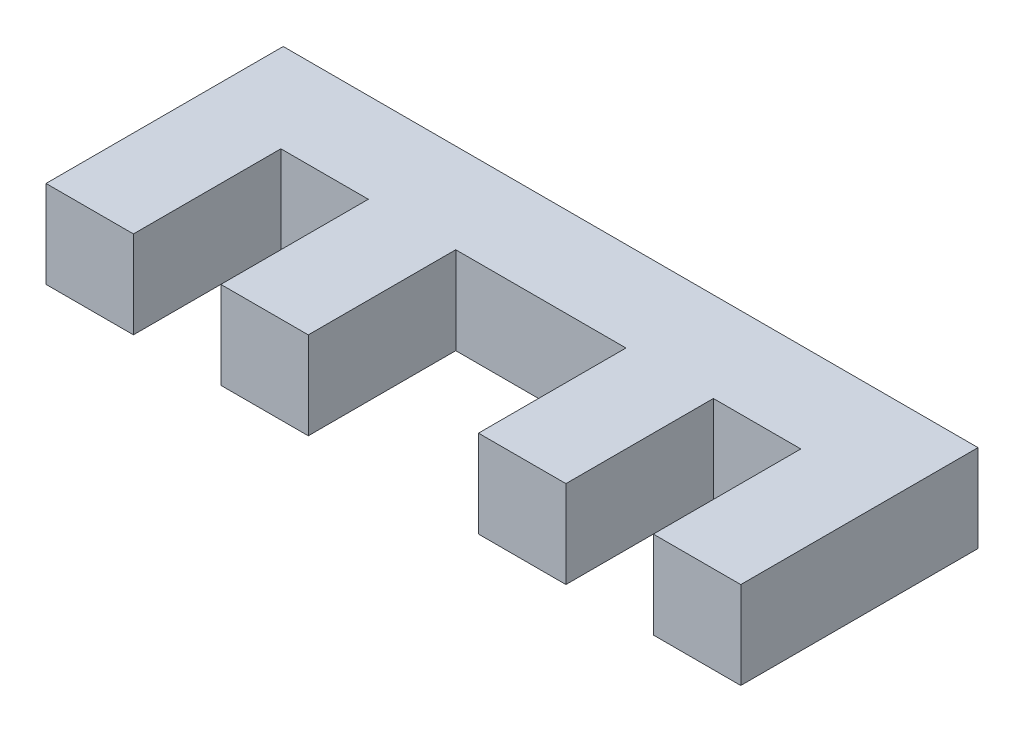
ISO-10303-21;
HEADER;
FILE_DESCRIPTION(('STEP AP214'),'2;1');
FILE_NAME('part.step','',(''),(''),'','','');
FILE_SCHEMA(('AUTOMOTIVE_DESIGN { 1 0 10303 214 1 1 1 1 }'));
ENDSEC;
DATA;
#1=APPLICATION_CONTEXT('core data for automotive mechanical design processes');
#2=APPLICATION_PROTOCOL_DEFINITION('international standard','automotive_design',2000,#1);
#3=PRODUCT_CONTEXT('',#1,'mechanical');
#4=PRODUCT('Part','Part','',(#3));
#5=PRODUCT_RELATED_PRODUCT_CATEGORY('part','',(#4));
#6=PRODUCT_DEFINITION_FORMATION('','',#4);
#7=PRODUCT_DEFINITION_CONTEXT('part definition',#1,'design');
#8=PRODUCT_DEFINITION('design','',#6,#7);
#9=PRODUCT_DEFINITION_SHAPE('','',#8);
#10=(LENGTH_UNIT() NAMED_UNIT(*) SI_UNIT(.MILLI.,.METRE.));
#11=(NAMED_UNIT(*) PLANE_ANGLE_UNIT() SI_UNIT($,.RADIAN.));
#12=(NAMED_UNIT(*) SI_UNIT($,.STERADIAN.) SOLID_ANGLE_UNIT());
#13=UNCERTAINTY_MEASURE_WITH_UNIT(LENGTH_MEASURE(1.E-05),#10,'distance_accuracy_value','');
#14=(GEOMETRIC_REPRESENTATION_CONTEXT(3) GLOBAL_UNCERTAINTY_ASSIGNED_CONTEXT((#13)) GLOBAL_UNIT_ASSIGNED_CONTEXT((#10,
#11,#12)) REPRESENTATION_CONTEXT('',''));
#15=CARTESIAN_POINT('',(0.,0.,0.));
#16=DIRECTION('',(0.,0.,1.));
#17=DIRECTION('',(1.,0.,0.));
#18=AXIS2_PLACEMENT_3D('',#15,#16,#17);
#19=CARTESIAN_POINT('',(0.,3.175,-8.61483333333333));
#20=DIRECTION('',(1.,0.,0.));
#21=DIRECTION('',(0.,0.,-1.));
#22=AXIS2_PLACEMENT_3D('',#19,#20,#21);
#23=PLANE('',#22);
#24=DIRECTION('',(0.,0.,1.));
#25=VECTOR('',#24,1.);
#26=CARTESIAN_POINT('',(0.,0.,-8.61483333333333));
#27=LINE('',#26,#25);
#28=CARTESIAN_POINT('',(0.,0.,-8.61483333333333));
#29=VERTEX_POINT('',#28);
#30=CARTESIAN_POINT('',(0.,0.,0.));
#31=VERTEX_POINT('',#30);
#32=EDGE_CURVE('E188',#29,#31,#27,.T.);
#33=ORIENTED_EDGE('',*,*,#32,.T.);
#34=DIRECTION('',(0.,-1.,0.));
#35=VECTOR('',#34,1.);
#36=CARTESIAN_POINT('',(0.,3.175,0.));
#37=LINE('',#36,#35);
#38=CARTESIAN_POINT('',(0.,3.175,0.));
#39=VERTEX_POINT('',#38);
#40=EDGE_CURVE('E11',#39,#31,#37,.T.);
#41=ORIENTED_EDGE('',*,*,#40,.F.);
#42=DIRECTION('',(0.,0.,1.));
#43=VECTOR('',#42,1.);
#44=CARTESIAN_POINT('',(0.,3.175,-8.61483333333333));
#45=LINE('',#44,#43);
#46=CARTESIAN_POINT('',(0.,3.175,-8.61483333333333));
#47=VERTEX_POINT('',#46);
#48=EDGE_CURVE('E234',#47,#39,#45,.T.);
#49=ORIENTED_EDGE('',*,*,#48,.F.);
#50=DIRECTION('',(0.,-1.,0.));
#51=VECTOR('',#50,1.);
#52=CARTESIAN_POINT('',(0.,3.175,-8.61483333333333));
#53=LINE('',#52,#51);
#54=EDGE_CURVE('E184',#47,#29,#53,.T.);
#55=ORIENTED_EDGE('',*,*,#54,.T.);
#56=EDGE_LOOP('',(#33,#41,#49,#55));
#57=FACE_BOUND('',#56,.T.);
#58=ADVANCED_FACE('F39',(#57),#23,.F.);
#59=CARTESIAN_POINT('',(0.,3.175,0.));
#60=DIRECTION('',(0.,0.,-1.));
#61=DIRECTION('',(-1.,0.,0.));
#62=AXIS2_PLACEMENT_3D('',#59,#60,#61);
#63=PLANE('',#62);
#64=DIRECTION('',(1.,0.,0.));
#65=VECTOR('',#64,1.);
#66=CARTESIAN_POINT('',(0.,0.,0.));
#67=LINE('',#66,#65);
#68=CARTESIAN_POINT('',(3.175,0.,0.));
#69=VERTEX_POINT('',#68);
#70=EDGE_CURVE('E192',#31,#69,#67,.T.);
#71=ORIENTED_EDGE('',*,*,#70,.T.);
#72=DIRECTION('',(0.,-1.,0.));
#73=VECTOR('',#72,1.);
#74=CARTESIAN_POINT('',(3.175,3.175,0.));
#75=LINE('',#74,#73);
#76=CARTESIAN_POINT('',(3.175,3.175,0.));
#77=VERTEX_POINT('',#76);
#78=EDGE_CURVE('E48',#77,#69,#75,.T.);
#79=ORIENTED_EDGE('',*,*,#78,.F.);
#80=DIRECTION('',(1.,0.,0.));
#81=VECTOR('',#80,1.);
#82=CARTESIAN_POINT('',(0.,3.175,0.));
#83=LINE('',#82,#81);
#84=EDGE_CURVE('E123',#39,#77,#83,.T.);
#85=ORIENTED_EDGE('',*,*,#84,.F.);
#86=ORIENTED_EDGE('',*,*,#40,.T.);
#87=EDGE_LOOP('',(#71,#79,#85,#86));
#88=FACE_BOUND('',#87,.T.);
#89=ADVANCED_FACE('F356',(#88),#63,.F.);
#90=CARTESIAN_POINT('',(3.175,3.175,0.));
#91=DIRECTION('',(-1.,0.,0.));
#92=DIRECTION('',(0.,0.,1.));
#93=AXIS2_PLACEMENT_3D('',#90,#91,#92);
#94=PLANE('',#93);
#95=DIRECTION('',(0.,0.,-1.));
#96=VECTOR('',#95,1.);
#97=CARTESIAN_POINT('',(3.175,0.,0.));
#98=LINE('',#97,#96);
#99=CARTESIAN_POINT('',(3.175,0.,-5.35516666666666));
#100=VERTEX_POINT('',#99);
#101=EDGE_CURVE('E195',#69,#100,#98,.T.);
#102=ORIENTED_EDGE('',*,*,#101,.T.);
#103=DIRECTION('',(0.,-1.,0.));
#104=VECTOR('',#103,1.);
#105=CARTESIAN_POINT('',(3.175,3.175,-5.35516666666666));
#106=LINE('',#105,#104);
#107=CARTESIAN_POINT('',(3.175,3.175,-5.35516666666666));
#108=VERTEX_POINT('',#107);
#109=EDGE_CURVE('E277',#108,#100,#106,.T.);
#110=ORIENTED_EDGE('',*,*,#109,.F.);
#111=DIRECTION('',(0.,0.,-1.));
#112=VECTOR('',#111,1.);
#113=CARTESIAN_POINT('',(3.175,3.175,0.));
#114=LINE('',#113,#112);
#115=EDGE_CURVE('E287',#77,#108,#114,.T.);
#116=ORIENTED_EDGE('',*,*,#115,.F.);
#117=ORIENTED_EDGE('',*,*,#78,.T.);
#118=EDGE_LOOP('',(#102,#110,#116,#117));
#119=FACE_BOUND('',#118,.T.);
#120=ADVANCED_FACE('F285',(#119),#94,.F.);
#121=CARTESIAN_POINT('',(3.175,3.175,-5.35516666666666));
#122=DIRECTION('',(0.,0.,-1.));
#123=DIRECTION('',(-1.,0.,0.));
#124=AXIS2_PLACEMENT_3D('',#121,#122,#123);
#125=PLANE('',#124);
#126=DIRECTION('',(1.,0.,0.));
#127=VECTOR('',#126,1.);
#128=CARTESIAN_POINT('',(3.175,0.,-5.35516666666666));
#129=LINE('',#128,#127);
#130=CARTESIAN_POINT('',(6.35,0.,-5.35516666666666));
#131=VERTEX_POINT('',#130);
#132=EDGE_CURVE('E198',#100,#131,#129,.T.);
#133=ORIENTED_EDGE('',*,*,#132,.T.);
#134=DIRECTION('',(0.,-1.,0.));
#135=VECTOR('',#134,1.);
#136=CARTESIAN_POINT('',(6.35,3.175,-5.35516666666666));
#137=LINE('',#136,#135);
#138=CARTESIAN_POINT('',(6.35,3.175,-5.35516666666666));
#139=VERTEX_POINT('',#138);
#140=EDGE_CURVE('E273',#139,#131,#137,.T.);
#141=ORIENTED_EDGE('',*,*,#140,.F.);
#142=DIRECTION('',(1.,0.,0.));
#143=VECTOR('',#142,1.);
#144=CARTESIAN_POINT('',(3.175,3.175,-5.35516666666666));
#145=LINE('',#144,#143);
#146=EDGE_CURVE('E306',#108,#139,#145,.T.);
#147=ORIENTED_EDGE('',*,*,#146,.F.);
#148=ORIENTED_EDGE('',*,*,#109,.T.);
#149=EDGE_LOOP('',(#133,#141,#147,#148));
#150=FACE_BOUND('',#149,.T.);
#151=ADVANCED_FACE('F296',(#150),#125,.F.);
#152=CARTESIAN_POINT('',(6.35,3.175,-5.35516666666666));
#153=DIRECTION('',(1.,0.,0.));
#154=DIRECTION('',(0.,0.,-1.));
#155=AXIS2_PLACEMENT_3D('',#152,#153,#154);
#156=PLANE('',#155);
#157=DIRECTION('',(0.,0.,1.));
#158=VECTOR('',#157,1.);
#159=CARTESIAN_POINT('',(6.35,0.,-5.35516666666666));
#160=LINE('',#159,#158);
#161=CARTESIAN_POINT('',(6.35,0.,0.));
#162=VERTEX_POINT('',#161);
#163=EDGE_CURVE('E201',#131,#162,#160,.T.);
#164=ORIENTED_EDGE('',*,*,#163,.T.);
#165=DIRECTION('',(0.,-1.,0.));
#166=VECTOR('',#165,1.);
#167=CARTESIAN_POINT('',(6.35,3.175,0.));
#168=LINE('',#167,#166);
#169=CARTESIAN_POINT('',(6.35,3.175,0.));
#170=VERTEX_POINT('',#169);
#171=EDGE_CURVE('E269',#170,#162,#168,.T.);
#172=ORIENTED_EDGE('',*,*,#171,.F.);
#173=DIRECTION('',(0.,0.,1.));
#174=VECTOR('',#173,1.);
#175=CARTESIAN_POINT('',(6.35,3.175,-5.35516666666666));
#176=LINE('',#175,#174);
#177=EDGE_CURVE('E302',#139,#170,#176,.T.);
#178=ORIENTED_EDGE('',*,*,#177,.F.);
#179=ORIENTED_EDGE('',*,*,#140,.T.);
#180=EDGE_LOOP('',(#164,#172,#178,#179));
#181=FACE_BOUND('',#180,.T.);
#182=ADVANCED_FACE('F300',(#181),#156,.F.);
#183=CARTESIAN_POINT('',(6.35,3.175,0.));
#184=DIRECTION('',(0.,0.,-1.));
#185=DIRECTION('',(-1.,0.,0.));
#186=AXIS2_PLACEMENT_3D('',#183,#184,#185);
#187=PLANE('',#186);
#188=DIRECTION('',(1.,0.,0.));
#189=VECTOR('',#188,1.);
#190=CARTESIAN_POINT('',(6.35,0.,0.));
#191=LINE('',#190,#189);
#192=CARTESIAN_POINT('',(9.525,0.,0.));
#193=VERTEX_POINT('',#192);
#194=EDGE_CURVE('E204',#162,#193,#191,.T.);
#195=ORIENTED_EDGE('',*,*,#194,.T.);
#196=DIRECTION('',(0.,-1.,0.));
#197=VECTOR('',#196,1.);
#198=CARTESIAN_POINT('',(9.525,3.175,0.));
#199=LINE('',#198,#197);
#200=CARTESIAN_POINT('',(9.525,3.175,0.));
#201=VERTEX_POINT('',#200);
#202=EDGE_CURVE('E265',#201,#193,#199,.T.);
#203=ORIENTED_EDGE('',*,*,#202,.F.);
#204=DIRECTION('',(1.,0.,0.));
#205=VECTOR('',#204,1.);
#206=CARTESIAN_POINT('',(6.35,3.175,0.));
#207=LINE('',#206,#205);
#208=EDGE_CURVE('E305',#170,#201,#207,.T.);
#209=ORIENTED_EDGE('',*,*,#208,.F.);
#210=ORIENTED_EDGE('',*,*,#171,.T.);
#211=EDGE_LOOP('',(#195,#203,#209,#210));
#212=FACE_BOUND('',#211,.T.);
#213=ADVANCED_FACE('F369',(#212),#187,.F.);
#214=CARTESIAN_POINT('',(9.525,3.175,0.));
#215=DIRECTION('',(-1.,0.,0.));
#216=DIRECTION('',(0.,0.,1.));
#217=AXIS2_PLACEMENT_3D('',#214,#215,#216);
#218=PLANE('',#217);
#219=DIRECTION('',(0.,0.,-1.));
#220=VECTOR('',#219,1.);
#221=CARTESIAN_POINT('',(9.525,0.,0.));
#222=LINE('',#221,#220);
#223=CARTESIAN_POINT('',(9.525,0.,-5.35516666666666));
#224=VERTEX_POINT('',#223);
#225=EDGE_CURVE('E207',#193,#224,#222,.T.);
#226=ORIENTED_EDGE('',*,*,#225,.T.);
#227=DIRECTION('',(0.,-1.,0.));
#228=VECTOR('',#227,1.);
#229=CARTESIAN_POINT('',(9.525,3.175,-5.35516666666666));
#230=LINE('',#229,#228);
#231=CARTESIAN_POINT('',(9.525,3.175,-5.35516666666666));
#232=VERTEX_POINT('',#231);
#233=EDGE_CURVE('E261',#232,#224,#230,.T.);
#234=ORIENTED_EDGE('',*,*,#233,.F.);
#235=DIRECTION('',(0.,0.,-1.));
#236=VECTOR('',#235,1.);
#237=CARTESIAN_POINT('',(9.525,3.175,0.));
#238=LINE('',#237,#236);
#239=EDGE_CURVE('E310',#201,#232,#238,.T.);
#240=ORIENTED_EDGE('',*,*,#239,.F.);
#241=ORIENTED_EDGE('',*,*,#202,.T.);
#242=EDGE_LOOP('',(#226,#234,#240,#241));
#243=FACE_BOUND('',#242,.T.);
#244=ADVANCED_FACE('F372',(#243),#218,.F.);
#245=CARTESIAN_POINT('',(9.525,3.175,-5.35516666666666));
#246=DIRECTION('',(0.,0.,-1.));
#247=DIRECTION('',(-1.,0.,0.));
#248=AXIS2_PLACEMENT_3D('',#245,#246,#247);
#249=PLANE('',#248);
#250=DIRECTION('',(1.,0.,0.));
#251=VECTOR('',#250,1.);
#252=CARTESIAN_POINT('',(9.525,0.,-5.35516666666666));
#253=LINE('',#252,#251);
#254=CARTESIAN_POINT('',(15.7056666666667,0.,-5.35516666666666));
#255=VERTEX_POINT('',#254);
#256=EDGE_CURVE('E210',#224,#255,#253,.T.);
#257=ORIENTED_EDGE('',*,*,#256,.T.);
#258=DIRECTION('',(0.,-1.,0.));
#259=VECTOR('',#258,1.);
#260=CARTESIAN_POINT('',(15.7056666666667,3.175,-5.35516666666666));
#261=LINE('',#260,#259);
#262=CARTESIAN_POINT('',(15.7056666666667,3.175,-5.35516666666666));
#263=VERTEX_POINT('',#262);
#264=EDGE_CURVE('E257',#263,#255,#261,.T.);
#265=ORIENTED_EDGE('',*,*,#264,.F.);
#266=DIRECTION('',(1.,0.,0.));
#267=VECTOR('',#266,1.);
#268=CARTESIAN_POINT('',(9.525,3.175,-5.35516666666666));
#269=LINE('',#268,#267);
#270=EDGE_CURVE('E317',#232,#263,#269,.T.);
#271=ORIENTED_EDGE('',*,*,#270,.F.);
#272=ORIENTED_EDGE('',*,*,#233,.T.);
#273=EDGE_LOOP('',(#257,#265,#271,#272));
#274=FACE_BOUND('',#273,.T.);
#275=ADVANCED_FACE('F376',(#274),#249,.F.);
#276=CARTESIAN_POINT('',(15.7056666666667,3.175,-5.35516666666666));
#277=DIRECTION('',(1.,0.,0.));
#278=DIRECTION('',(0.,0.,-1.));
#279=AXIS2_PLACEMENT_3D('',#276,#277,#278);
#280=PLANE('',#279);
#281=DIRECTION('',(0.,0.,1.));
#282=VECTOR('',#281,1.);
#283=CARTESIAN_POINT('',(15.7056666666667,0.,-5.35516666666666));
#284=LINE('',#283,#282);
#285=CARTESIAN_POINT('',(15.7056666666667,0.,0.));
#286=VERTEX_POINT('',#285);
#287=EDGE_CURVE('E213',#255,#286,#284,.T.);
#288=ORIENTED_EDGE('',*,*,#287,.T.);
#289=DIRECTION('',(0.,-1.,0.));
#290=VECTOR('',#289,1.);
#291=CARTESIAN_POINT('',(15.7056666666667,3.175,0.));
#292=LINE('',#291,#290);
#293=CARTESIAN_POINT('',(15.7056666666667,3.175,0.));
#294=VERTEX_POINT('',#293);
#295=EDGE_CURVE('E253',#294,#286,#292,.T.);
#296=ORIENTED_EDGE('',*,*,#295,.F.);
#297=DIRECTION('',(0.,0.,1.));
#298=VECTOR('',#297,1.);
#299=CARTESIAN_POINT('',(15.7056666666667,3.175,-5.35516666666666));
#300=LINE('',#299,#298);
#301=EDGE_CURVE('E320',#263,#294,#300,.T.);
#302=ORIENTED_EDGE('',*,*,#301,.F.);
#303=ORIENTED_EDGE('',*,*,#264,.T.);
#304=EDGE_LOOP('',(#288,#296,#302,#303));
#305=FACE_BOUND('',#304,.T.);
#306=ADVANCED_FACE('F380',(#305),#280,.F.);
#307=CARTESIAN_POINT('',(15.7056666666667,3.175,0.));
#308=DIRECTION('',(0.,0.,-1.));
#309=DIRECTION('',(-1.,0.,0.));
#310=AXIS2_PLACEMENT_3D('',#307,#308,#309);
#311=PLANE('',#310);
#312=DIRECTION('',(1.,0.,0.));
#313=VECTOR('',#312,1.);
#314=CARTESIAN_POINT('',(15.7056666666667,0.,0.));
#315=LINE('',#314,#313);
#316=CARTESIAN_POINT('',(18.8806666666667,0.,0.));
#317=VERTEX_POINT('',#316);
#318=EDGE_CURVE('E216',#286,#317,#315,.T.);
#319=ORIENTED_EDGE('',*,*,#318,.T.);
#320=DIRECTION('',(0.,-1.,0.));
#321=VECTOR('',#320,1.);
#322=CARTESIAN_POINT('',(18.8806666666667,3.175,0.));
#323=LINE('',#322,#321);
#324=CARTESIAN_POINT('',(18.8806666666667,3.175,0.));
#325=VERTEX_POINT('',#324);
#326=EDGE_CURVE('E249',#325,#317,#323,.T.);
#327=ORIENTED_EDGE('',*,*,#326,.F.);
#328=DIRECTION('',(1.,0.,0.));
#329=VECTOR('',#328,1.);
#330=CARTESIAN_POINT('',(15.7056666666667,3.175,0.));
#331=LINE('',#330,#329);
#332=EDGE_CURVE('E323',#294,#325,#331,.T.);
#333=ORIENTED_EDGE('',*,*,#332,.F.);
#334=ORIENTED_EDGE('',*,*,#295,.T.);
#335=EDGE_LOOP('',(#319,#327,#333,#334));
#336=FACE_BOUND('',#335,.T.);
#337=ADVANCED_FACE('F384',(#336),#311,.F.);
#338=CARTESIAN_POINT('',(18.8806666666667,3.175,0.));
#339=DIRECTION('',(-1.,0.,0.));
#340=DIRECTION('',(0.,0.,1.));
#341=AXIS2_PLACEMENT_3D('',#338,#339,#340);
#342=PLANE('',#341);
#343=DIRECTION('',(0.,0.,-1.));
#344=VECTOR('',#343,1.);
#345=CARTESIAN_POINT('',(18.8806666666667,0.,0.));
#346=LINE('',#345,#344);
#347=CARTESIAN_POINT('',(18.8806666666667,0.,-5.35516666666666));
#348=VERTEX_POINT('',#347);
#349=EDGE_CURVE('E219',#317,#348,#346,.T.);
#350=ORIENTED_EDGE('',*,*,#349,.T.);
#351=DIRECTION('',(0.,-1.,0.));
#352=VECTOR('',#351,1.);
#353=CARTESIAN_POINT('',(18.8806666666667,3.175,-5.35516666666666));
#354=LINE('',#353,#352);
#355=CARTESIAN_POINT('',(18.8806666666667,3.175,-5.35516666666666));
#356=VERTEX_POINT('',#355);
#357=EDGE_CURVE('E245',#356,#348,#354,.T.);
#358=ORIENTED_EDGE('',*,*,#357,.F.);
#359=DIRECTION('',(0.,0.,-1.));
#360=VECTOR('',#359,1.);
#361=CARTESIAN_POINT('',(18.8806666666667,3.175,0.));
#362=LINE('',#361,#360);
#363=EDGE_CURVE('E326',#325,#356,#362,.T.);
#364=ORIENTED_EDGE('',*,*,#363,.F.);
#365=ORIENTED_EDGE('',*,*,#326,.T.);
#366=EDGE_LOOP('',(#350,#358,#364,#365));
#367=FACE_BOUND('',#366,.T.);
#368=ADVANCED_FACE('F388',(#367),#342,.F.);
#369=CARTESIAN_POINT('',(18.8806666666667,3.175,-5.35516666666666));
#370=DIRECTION('',(0.,0.,-1.));
#371=DIRECTION('',(-1.,0.,0.));
#372=AXIS2_PLACEMENT_3D('',#369,#370,#371);
#373=PLANE('',#372);
#374=DIRECTION('',(1.,0.,0.));
#375=VECTOR('',#374,1.);
#376=CARTESIAN_POINT('',(18.8806666666667,0.,-5.35516666666666));
#377=LINE('',#376,#375);
#378=CARTESIAN_POINT('',(22.0556666666667,0.,-5.35516666666666));
#379=VERTEX_POINT('',#378);
#380=EDGE_CURVE('E222',#348,#379,#377,.T.);
#381=ORIENTED_EDGE('',*,*,#380,.T.);
#382=DIRECTION('',(0.,-1.,0.));
#383=VECTOR('',#382,1.);
#384=CARTESIAN_POINT('',(22.0556666666667,3.175,-5.35516666666666));
#385=LINE('',#384,#383);
#386=CARTESIAN_POINT('',(22.0556666666667,3.175,-5.35516666666666));
#387=VERTEX_POINT('',#386);
#388=EDGE_CURVE('E241',#387,#379,#385,.T.);
#389=ORIENTED_EDGE('',*,*,#388,.F.);
#390=DIRECTION('',(1.,0.,0.));
#391=VECTOR('',#390,1.);
#392=CARTESIAN_POINT('',(18.8806666666667,3.175,-5.35516666666666));
#393=LINE('',#392,#391);
#394=EDGE_CURVE('E329',#356,#387,#393,.T.);
#395=ORIENTED_EDGE('',*,*,#394,.F.);
#396=ORIENTED_EDGE('',*,*,#357,.T.);
#397=EDGE_LOOP('',(#381,#389,#395,#396));
#398=FACE_BOUND('',#397,.T.);
#399=ADVANCED_FACE('F337',(#398),#373,.F.);
#400=CARTESIAN_POINT('',(22.0556666666667,3.175,-5.35516666666666));
#401=DIRECTION('',(1.,0.,0.));
#402=DIRECTION('',(0.,0.,-1.));
#403=AXIS2_PLACEMENT_3D('',#400,#401,#402);
#404=PLANE('',#403);
#405=DIRECTION('',(0.,0.,1.));
#406=VECTOR('',#405,1.);
#407=CARTESIAN_POINT('',(22.0556666666667,0.,-5.35516666666666));
#408=LINE('',#407,#406);
#409=CARTESIAN_POINT('',(22.0556666666667,0.,0.));
#410=VERTEX_POINT('',#409);
#411=EDGE_CURVE('E225',#379,#410,#408,.T.);
#412=ORIENTED_EDGE('',*,*,#411,.T.);
#413=DIRECTION('',(0.,-1.,0.));
#414=VECTOR('',#413,1.);
#415=CARTESIAN_POINT('',(22.0556666666667,3.175,0.));
#416=LINE('',#415,#414);
#417=CARTESIAN_POINT('',(22.0556666666667,3.175,0.));
#418=VERTEX_POINT('',#417);
#419=EDGE_CURVE('E177',#418,#410,#416,.T.);
#420=ORIENTED_EDGE('',*,*,#419,.F.);
#421=DIRECTION('',(0.,0.,1.));
#422=VECTOR('',#421,1.);
#423=CARTESIAN_POINT('',(22.0556666666667,3.175,-5.35516666666666));
#424=LINE('',#423,#422);
#425=EDGE_CURVE('E166',#387,#418,#424,.T.);
#426=ORIENTED_EDGE('',*,*,#425,.F.);
#427=ORIENTED_EDGE('',*,*,#388,.T.);
#428=EDGE_LOOP('',(#412,#420,#426,#427));
#429=FACE_BOUND('',#428,.T.);
#430=ADVANCED_FACE('F341',(#429),#404,.F.);
#431=CARTESIAN_POINT('',(22.0556666666667,3.175,0.));
#432=DIRECTION('',(0.,0.,-1.));
#433=DIRECTION('',(-1.,0.,0.));
#434=AXIS2_PLACEMENT_3D('',#431,#432,#433);
#435=PLANE('',#434);
#436=DIRECTION('',(1.,0.,0.));
#437=VECTOR('',#436,1.);
#438=CARTESIAN_POINT('',(22.0556666666667,0.,0.));
#439=LINE('',#438,#437);
#440=CARTESIAN_POINT('',(25.2306666666667,0.,0.));
#441=VERTEX_POINT('',#440);
#442=EDGE_CURVE('E175',#410,#441,#439,.T.);
#443=ORIENTED_EDGE('',*,*,#442,.T.);
#444=DIRECTION('',(0.,-1.,0.));
#445=VECTOR('',#444,1.);
#446=CARTESIAN_POINT('',(25.2306666666667,3.175,0.));
#447=LINE('',#446,#445);
#448=CARTESIAN_POINT('',(25.2306666666667,3.175,0.));
#449=VERTEX_POINT('',#448);
#450=EDGE_CURVE('E172',#449,#441,#447,.T.);
#451=ORIENTED_EDGE('',*,*,#450,.F.);
#452=DIRECTION('',(1.,0.,0.));
#453=VECTOR('',#452,1.);
#454=CARTESIAN_POINT('',(22.0556666666667,3.175,0.));
#455=LINE('',#454,#453);
#456=EDGE_CURVE('E160',#418,#449,#455,.T.);
#457=ORIENTED_EDGE('',*,*,#456,.F.);
#458=ORIENTED_EDGE('',*,*,#419,.T.);
#459=EDGE_LOOP('',(#443,#451,#457,#458));
#460=FACE_BOUND('',#459,.T.);
#461=ADVANCED_FACE('F173',(#460),#435,.F.);
#462=CARTESIAN_POINT('',(25.2306666666667,3.175,0.));
#463=DIRECTION('',(-1.,0.,0.));
#464=DIRECTION('',(0.,0.,1.));
#465=AXIS2_PLACEMENT_3D('',#462,#463,#464);
#466=PLANE('',#465);
#467=DIRECTION('',(0.,0.,-1.));
#468=VECTOR('',#467,1.);
#469=CARTESIAN_POINT('',(25.2306666666667,0.,0.));
#470=LINE('',#469,#468);
#471=CARTESIAN_POINT('',(25.2306666666667,0.,-8.61483333333333));
#472=VERTEX_POINT('',#471);
#473=EDGE_CURVE('E109',#441,#472,#470,.T.);
#474=ORIENTED_EDGE('',*,*,#473,.T.);
#475=DIRECTION('',(0.,-1.,0.));
#476=VECTOR('',#475,1.);
#477=CARTESIAN_POINT('',(25.2306666666667,3.175,-8.61483333333333));
#478=LINE('',#477,#476);
#479=CARTESIAN_POINT('',(25.2306666666667,3.175,-8.61483333333333));
#480=VERTEX_POINT('',#479);
#481=EDGE_CURVE('E178',#480,#472,#478,.T.);
#482=ORIENTED_EDGE('',*,*,#481,.F.);
#483=DIRECTION('',(0.,0.,-1.));
#484=VECTOR('',#483,1.);
#485=CARTESIAN_POINT('',(25.2306666666667,3.175,0.));
#486=LINE('',#485,#484);
#487=EDGE_CURVE('E164',#449,#480,#486,.T.);
#488=ORIENTED_EDGE('',*,*,#487,.F.);
#489=ORIENTED_EDGE('',*,*,#450,.T.);
#490=EDGE_LOOP('',(#474,#482,#488,#489));
#491=FACE_BOUND('',#490,.T.);
#492=ADVANCED_FACE('F180',(#491),#466,.F.);
#493=CARTESIAN_POINT('',(25.2306666666667,3.175,-8.61483333333333));
#494=DIRECTION('',(0.,0.,1.));
#495=DIRECTION('',(1.,0.,0.));
#496=AXIS2_PLACEMENT_3D('',#493,#494,#495);
#497=PLANE('',#496);
#498=DIRECTION('',(-1.,0.,0.));
#499=VECTOR('',#498,1.);
#500=CARTESIAN_POINT('',(25.2306666666667,0.,-8.61483333333333));
#501=LINE('',#500,#499);
#502=EDGE_CURVE('E115',#472,#29,#501,.T.);
#503=ORIENTED_EDGE('',*,*,#502,.T.);
#504=ORIENTED_EDGE('',*,*,#54,.F.);
#505=DIRECTION('',(-1.,0.,0.));
#506=VECTOR('',#505,1.);
#507=CARTESIAN_POINT('',(25.2306666666667,3.175,-8.61483333333333));
#508=LINE('',#507,#506);
#509=EDGE_CURVE('E56',#480,#47,#508,.T.);
#510=ORIENTED_EDGE('',*,*,#509,.F.);
#511=ORIENTED_EDGE('',*,*,#481,.T.);
#512=EDGE_LOOP('',(#503,#504,#510,#511));
#513=FACE_BOUND('',#512,.T.);
#514=ADVANCED_FACE('F345',(#513),#497,.F.);
#515=CARTESIAN_POINT('',(0.,3.175,0.));
#516=DIRECTION('',(0.,1.,0.));
#517=DIRECTION('',(0.,0.,1.));
#518=AXIS2_PLACEMENT_3D('',#515,#516,#517);
#519=PLANE('',#518);
#520=ORIENTED_EDGE('',*,*,#48,.T.);
#521=ORIENTED_EDGE('',*,*,#84,.T.);
#522=ORIENTED_EDGE('',*,*,#115,.T.);
#523=ORIENTED_EDGE('',*,*,#146,.T.);
#524=ORIENTED_EDGE('',*,*,#177,.T.);
#525=ORIENTED_EDGE('',*,*,#208,.T.);
#526=ORIENTED_EDGE('',*,*,#239,.T.);
#527=ORIENTED_EDGE('',*,*,#270,.T.);
#528=ORIENTED_EDGE('',*,*,#301,.T.);
#529=ORIENTED_EDGE('',*,*,#332,.T.);
#530=ORIENTED_EDGE('',*,*,#363,.T.);
#531=ORIENTED_EDGE('',*,*,#394,.T.);
#532=ORIENTED_EDGE('',*,*,#425,.T.);
#533=ORIENTED_EDGE('',*,*,#456,.T.);
#534=ORIENTED_EDGE('',*,*,#487,.T.);
#535=ORIENTED_EDGE('',*,*,#509,.T.);
#536=EDGE_LOOP('',(#520,#521,#522,#523,#524,#525,#526,#527,#528,#529,#530,#531,#532,#533,#534,#535));
#537=FACE_BOUND('',#536,.T.);
#538=ADVANCED_FACE('F162',(#537),#519,.T.);
#539=CARTESIAN_POINT('',(0.,0.,0.));
#540=DIRECTION('',(0.,1.,0.));
#541=DIRECTION('',(0.,0.,1.));
#542=AXIS2_PLACEMENT_3D('',#539,#540,#541);
#543=PLANE('',#542);
#544=ORIENTED_EDGE('',*,*,#32,.F.);
#545=ORIENTED_EDGE('',*,*,#502,.F.);
#546=ORIENTED_EDGE('',*,*,#473,.F.);
#547=ORIENTED_EDGE('',*,*,#442,.F.);
#548=ORIENTED_EDGE('',*,*,#411,.F.);
#549=ORIENTED_EDGE('',*,*,#380,.F.);
#550=ORIENTED_EDGE('',*,*,#349,.F.);
#551=ORIENTED_EDGE('',*,*,#318,.F.);
#552=ORIENTED_EDGE('',*,*,#287,.F.);
#553=ORIENTED_EDGE('',*,*,#256,.F.);
#554=ORIENTED_EDGE('',*,*,#225,.F.);
#555=ORIENTED_EDGE('',*,*,#194,.F.);
#556=ORIENTED_EDGE('',*,*,#163,.F.);
#557=ORIENTED_EDGE('',*,*,#132,.F.);
#558=ORIENTED_EDGE('',*,*,#101,.F.);
#559=ORIENTED_EDGE('',*,*,#70,.F.);
#560=EDGE_LOOP('',(#544,#545,#546,#547,#548,#549,#550,#551,#552,#553,#554,#555,#556,#557,#558,#559));
#561=FACE_BOUND('',#560,.T.);
#562=ADVANCED_FACE('F291',(#561),#543,.F.);
#563=CLOSED_SHELL('',(#58,#89,#120,#151,#182,#213,#244,#275,#306,#337,#368,#399,#430,#461,#492,
#514,#538,#562));
#564=MANIFOLD_SOLID_BREP('B2',#563);
#565=ADVANCED_BREP_SHAPE_REPRESENTATION('',(#18,#564),#14);
#566=SHAPE_DEFINITION_REPRESENTATION(#9,#565);
ENDSEC;
END-ISO-10303-21;
